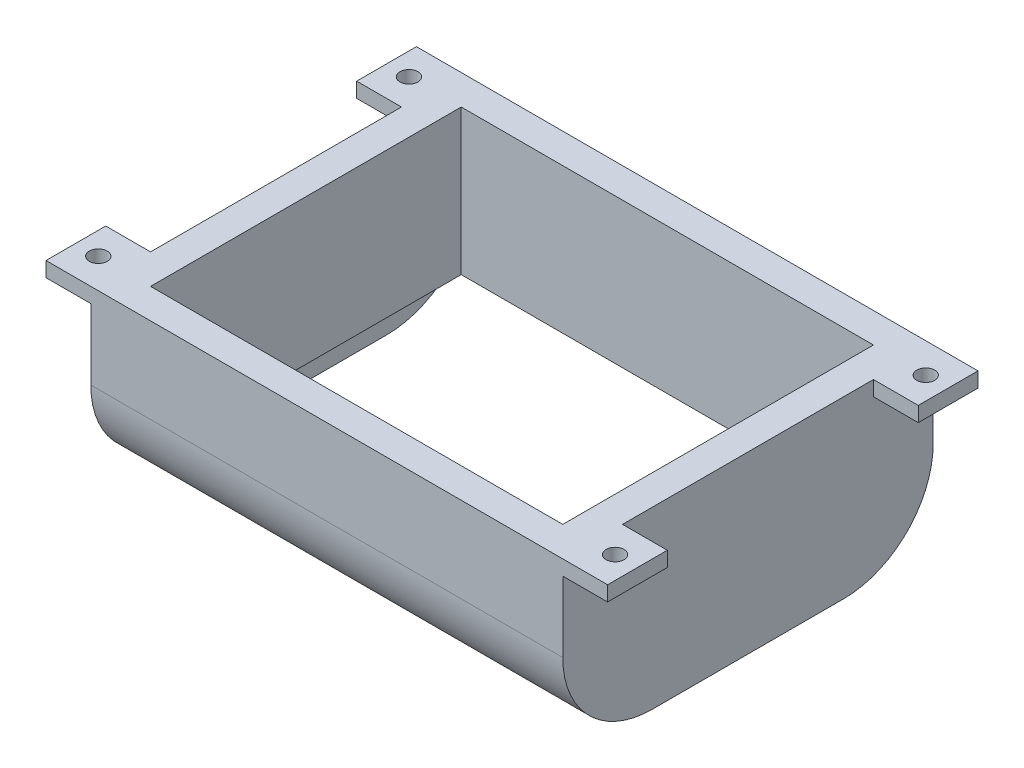
ISO-10303-21;
HEADER;
FILE_DESCRIPTION(('STEP AP214'),'2;1');
FILE_NAME('part.step','',(''),(''),'','','');
FILE_SCHEMA(('AUTOMOTIVE_DESIGN { 1 0 10303 214 1 1 1 1 }'));
ENDSEC;
DATA;
#1=APPLICATION_CONTEXT('core data for automotive mechanical design processes');
#2=APPLICATION_PROTOCOL_DEFINITION('international standard','automotive_design',2000,#1);
#3=PRODUCT_CONTEXT('',#1,'mechanical');
#4=PRODUCT('Part','Part','',(#3));
#5=PRODUCT_RELATED_PRODUCT_CATEGORY('part','',(#4));
#6=PRODUCT_DEFINITION_FORMATION('','',#4);
#7=PRODUCT_DEFINITION_CONTEXT('part definition',#1,'design');
#8=PRODUCT_DEFINITION('design','',#6,#7);
#9=PRODUCT_DEFINITION_SHAPE('','',#8);
#10=(LENGTH_UNIT() NAMED_UNIT(*) SI_UNIT(.MILLI.,.METRE.));
#11=(NAMED_UNIT(*) PLANE_ANGLE_UNIT() SI_UNIT($,.RADIAN.));
#12=(NAMED_UNIT(*) SI_UNIT($,.STERADIAN.) SOLID_ANGLE_UNIT());
#13=UNCERTAINTY_MEASURE_WITH_UNIT(LENGTH_MEASURE(1.E-05),#10,'distance_accuracy_value','');
#14=(GEOMETRIC_REPRESENTATION_CONTEXT(3) GLOBAL_UNCERTAINTY_ASSIGNED_CONTEXT((#13)) GLOBAL_UNIT_ASSIGNED_CONTEXT((#10,
#11,#12)) REPRESENTATION_CONTEXT('',''));
#15=CARTESIAN_POINT('',(0.,0.,0.));
#16=DIRECTION('',(0.,0.,1.));
#17=DIRECTION('',(1.,0.,0.));
#18=AXIS2_PLACEMENT_3D('',#15,#16,#17);
#19=CARTESIAN_POINT('',(0.,-5.,0.));
#20=DIRECTION('',(0.,1.,0.));
#21=DIRECTION('',(0.,0.,1.));
#22=AXIS2_PLACEMENT_3D('',#19,#20,#21);
#23=PLANE('',#22);
#24=DIRECTION('',(0.,0.,-1.));
#25=VECTOR('',#24,1.);
#26=CARTESIAN_POINT('',(-39.5,-5.,31.));
#27=LINE('',#26,#25);
#28=CARTESIAN_POINT('',(-39.4999999999999,-5.,16.));
#29=VERTEX_POINT('',#28);
#30=CARTESIAN_POINT('',(-39.4999999999999,-5.,-16.));
#31=VERTEX_POINT('',#30);
#32=EDGE_CURVE('E358',#29,#31,#27,.T.);
#33=ORIENTED_EDGE('',*,*,#32,.T.);
#34=DIRECTION('',(-1.,0.,0.));
#35=VECTOR('',#34,1.);
#36=CARTESIAN_POINT('',(0.,-5.,-16.));
#37=LINE('',#36,#35);
#38=CARTESIAN_POINT('',(-37.,-5.,-16.));
#39=VERTEX_POINT('',#38);
#40=EDGE_CURVE('E436',#31,#39,#37,.F.);
#41=ORIENTED_EDGE('',*,*,#40,.T.);
#42=DIRECTION('',(0.,0.,-1.));
#43=VECTOR('',#42,1.);
#44=CARTESIAN_POINT('',(-37.,-5.,0.));
#45=LINE('',#44,#43);
#46=CARTESIAN_POINT('',(-37.,-5.,16.));
#47=VERTEX_POINT('',#46);
#48=EDGE_CURVE('E349',#47,#39,#45,.T.);
#49=ORIENTED_EDGE('',*,*,#48,.F.);
#50=DIRECTION('',(-1.,0.,0.));
#51=VECTOR('',#50,1.);
#52=CARTESIAN_POINT('',(0.,-5.,16.));
#53=LINE('',#52,#51);
#54=EDGE_CURVE('E429',#47,#29,#53,.T.);
#55=ORIENTED_EDGE('',*,*,#54,.T.);
#56=EDGE_LOOP('',(#33,#41,#49,#55));
#57=FACE_BOUND('',#56,.T.);
#58=ADVANCED_FACE('F63',(#57),#23,.F.);
#59=CARTESIAN_POINT('',(-39.5,24.3,31.));
#60=DIRECTION('',(1.,0.,0.));
#61=DIRECTION('',(0.,0.,-1.));
#62=AXIS2_PLACEMENT_3D('',#59,#60,#61);
#63=PLANE('',#62);
#64=DIRECTION('',(0.,-1.,0.));
#65=VECTOR('',#64,1.);
#66=CARTESIAN_POINT('',(-39.4999999999999,24.3,-31.));
#67=LINE('',#66,#65);
#68=CARTESIAN_POINT('',(-39.4999999999999,21.8,-31.));
#69=VERTEX_POINT('',#68);
#70=CARTESIAN_POINT('',(-39.4999999999999,10.,-31.));
#71=VERTEX_POINT('',#70);
#72=EDGE_CURVE('E404',#69,#71,#67,.T.);
#73=ORIENTED_EDGE('',*,*,#72,.T.);
#74=CARTESIAN_POINT('',(-39.4999999999999,10.,-16.));
#75=DIRECTION('',(1.,0.,0.));
#76=DIRECTION('',(0.,0.,-1.));
#77=AXIS2_PLACEMENT_3D('',#74,#75,#76);
#78=CIRCLE('',#77,15.);
#79=EDGE_CURVE('E427',#71,#31,#78,.F.);
#80=ORIENTED_EDGE('',*,*,#79,.T.);
#81=ORIENTED_EDGE('',*,*,#32,.F.);
#82=CARTESIAN_POINT('',(-39.4999999999999,10.,16.));
#83=DIRECTION('',(1.,0.,0.));
#84=DIRECTION('',(0.,0.,-1.));
#85=AXIS2_PLACEMENT_3D('',#82,#83,#84);
#86=CIRCLE('',#85,15.);
#87=CARTESIAN_POINT('',(-39.5,10.,31.));
#88=VERTEX_POINT('',#87);
#89=EDGE_CURVE('E425',#29,#88,#86,.F.);
#90=ORIENTED_EDGE('',*,*,#89,.T.);
#91=DIRECTION('',(0.,-1.,0.));
#92=VECTOR('',#91,1.);
#93=CARTESIAN_POINT('',(-39.5,24.3,31.));
#94=LINE('',#93,#92);
#95=CARTESIAN_POINT('',(-39.5,21.8,31.));
#96=VERTEX_POINT('',#95);
#97=EDGE_CURVE('E402',#96,#88,#94,.T.);
#98=ORIENTED_EDGE('',*,*,#97,.F.);
#99=DIRECTION('',(0.,0.,1.));
#100=VECTOR('',#99,1.);
#101=CARTESIAN_POINT('',(-39.5,21.8,30.9999999999999));
#102=LINE('',#101,#100);
#103=CARTESIAN_POINT('',(-39.5,21.8,20.9999999999999));
#104=VERTEX_POINT('',#103);
#105=EDGE_CURVE('E307',#104,#96,#102,.T.);
#106=ORIENTED_EDGE('',*,*,#105,.F.);
#107=DIRECTION('',(0.,-1.,0.));
#108=VECTOR('',#107,1.);
#109=CARTESIAN_POINT('',(-39.5,24.3,20.9999999999999));
#110=LINE('',#109,#108);
#111=CARTESIAN_POINT('',(-39.5,24.3,20.9999999999999));
#112=VERTEX_POINT('',#111);
#113=EDGE_CURVE('E310',#112,#104,#110,.T.);
#114=ORIENTED_EDGE('',*,*,#113,.F.);
#115=DIRECTION('',(0.,0.,1.));
#116=VECTOR('',#115,1.);
#117=CARTESIAN_POINT('',(-39.5,24.3,31.));
#118=LINE('',#117,#116);
#119=CARTESIAN_POINT('',(-39.4999999999999,24.3,-21.));
#120=VERTEX_POINT('',#119);
#121=EDGE_CURVE('E396',#120,#112,#118,.T.);
#122=ORIENTED_EDGE('',*,*,#121,.F.);
#123=DIRECTION('',(0.,1.,0.));
#124=VECTOR('',#123,1.);
#125=CARTESIAN_POINT('',(-39.4999999999999,24.3,-21.));
#126=LINE('',#125,#124);
#127=CARTESIAN_POINT('',(-39.4999999999999,21.8,-21.));
#128=VERTEX_POINT('',#127);
#129=EDGE_CURVE('E325',#128,#120,#126,.T.);
#130=ORIENTED_EDGE('',*,*,#129,.F.);
#131=DIRECTION('',(0.,0.,1.));
#132=VECTOR('',#131,1.);
#133=CARTESIAN_POINT('',(-39.4999999999999,21.8,-31.));
#134=LINE('',#133,#132);
#135=EDGE_CURVE('E313',#69,#128,#134,.T.);
#136=ORIENTED_EDGE('',*,*,#135,.F.);
#137=EDGE_LOOP('',(#73,#80,#81,#90,#98,#106,#114,#122,#130,#136));
#138=FACE_BOUND('',#137,.T.);
#139=ADVANCED_FACE('F467',(#138),#63,.F.);
#140=CARTESIAN_POINT('',(0.,0.,0.));
#141=DIRECTION('',(0.,1.,0.));
#142=DIRECTION('',(0.,0.,1.));
#143=AXIS2_PLACEMENT_3D('',#140,#141,#142);
#144=PLANE('',#143);
#145=DIRECTION('',(0.,0.,1.));
#146=VECTOR('',#145,1.);
#147=CARTESIAN_POINT('',(-34.5,0.,26.));
#148=LINE('',#147,#146);
#149=CARTESIAN_POINT('',(-34.5,0.,-26.));
#150=VERTEX_POINT('',#149);
#151=CARTESIAN_POINT('',(-34.5,0.,26.));
#152=VERTEX_POINT('',#151);
#153=EDGE_CURVE('E361',#150,#152,#148,.T.);
#154=ORIENTED_EDGE('',*,*,#153,.T.);
#155=DIRECTION('',(1.,0.,0.));
#156=VECTOR('',#155,1.);
#157=CARTESIAN_POINT('',(34.5,0.,26.));
#158=LINE('',#157,#156);
#159=CARTESIAN_POINT('',(34.5,0.,26.));
#160=VERTEX_POINT('',#159);
#161=EDGE_CURVE('E375',#152,#160,#158,.T.);
#162=ORIENTED_EDGE('',*,*,#161,.T.);
#163=DIRECTION('',(0.,0.,-1.));
#164=VECTOR('',#163,1.);
#165=CARTESIAN_POINT('',(34.5,0.,26.));
#166=LINE('',#165,#164);
#167=CARTESIAN_POINT('',(34.5,0.,-26.));
#168=VERTEX_POINT('',#167);
#169=EDGE_CURVE('E378',#160,#168,#166,.T.);
#170=ORIENTED_EDGE('',*,*,#169,.T.);
#171=DIRECTION('',(-1.,0.,0.));
#172=VECTOR('',#171,1.);
#173=CARTESIAN_POINT('',(34.5,0.,-26.));
#174=LINE('',#173,#172);
#175=EDGE_CURVE('E365',#168,#150,#174,.T.);
#176=ORIENTED_EDGE('',*,*,#175,.T.);
#177=EDGE_LOOP('',(#154,#162,#170,#176));
#178=FACE_BOUND('',#177,.T.);
#179=DIRECTION('',(0.,0.,-1.));
#180=VECTOR('',#179,1.);
#181=CARTESIAN_POINT('',(-37.,0.,0.));
#182=LINE('',#181,#180);
#183=CARTESIAN_POINT('',(-37.,0.,27.1803398874989));
#184=VERTEX_POINT('',#183);
#185=CARTESIAN_POINT('',(-37.,0.,-27.180339887499));
#186=VERTEX_POINT('',#185);
#187=EDGE_CURVE('E350',#184,#186,#182,.T.);
#188=ORIENTED_EDGE('',*,*,#187,.T.);
#189=DIRECTION('',(-1.,0.,0.));
#190=VECTOR('',#189,1.);
#191=CARTESIAN_POINT('',(-37.,0.,-27.180339887499));
#192=LINE('',#191,#190);
#193=CARTESIAN_POINT('',(37.,0.,-27.180339887499));
#194=VERTEX_POINT('',#193);
#195=EDGE_CURVE('E84',#186,#194,#192,.F.);
#196=ORIENTED_EDGE('',*,*,#195,.T.);
#197=DIRECTION('',(0.,0.,-1.));
#198=VECTOR('',#197,1.);
#199=CARTESIAN_POINT('',(37.,0.,0.));
#200=LINE('',#199,#198);
#201=CARTESIAN_POINT('',(37.,0.,27.1803398874989));
#202=VERTEX_POINT('',#201);
#203=EDGE_CURVE('E345',#202,#194,#200,.T.);
#204=ORIENTED_EDGE('',*,*,#203,.F.);
#205=DIRECTION('',(-1.,0.,0.));
#206=VECTOR('',#205,1.);
#207=CARTESIAN_POINT('',(37.,0.,27.1803398874989));
#208=LINE('',#207,#206);
#209=EDGE_CURVE('E442',#202,#184,#208,.T.);
#210=ORIENTED_EDGE('',*,*,#209,.T.);
#211=EDGE_LOOP('',(#188,#196,#204,#210));
#212=FACE_BOUND('',#211,.T.);
#213=ADVANCED_FACE('F521',(#178,#212),#144,.F.);
#214=CARTESIAN_POINT('',(0.,24.3,0.));
#215=DIRECTION('',(0.,1.,0.));
#216=DIRECTION('',(0.,0.,1.));
#217=AXIS2_PLACEMENT_3D('',#214,#215,#216);
#218=PLANE('',#217);
#219=CARTESIAN_POINT('',(43.2499999999999,24.3000000000003,-25.9999999999998));
#220=DIRECTION('',(0.,-1.,0.));
#221=DIRECTION('',(0.,0.,1.));
#222=AXIS2_PLACEMENT_3D('',#219,#220,#221);
#223=CIRCLE('',#222,1.5);
#224=CARTESIAN_POINT('',(43.2499999999999,24.3000000000003,-24.4999999999998));
#225=VERTEX_POINT('',#224);
#226=EDGE_CURVE('E601',#225,#225,#223,.T.);
#227=ORIENTED_EDGE('',*,*,#226,.T.);
#228=EDGE_LOOP('',(#227));
#229=FACE_BOUND('',#228,.T.);
#230=CARTESIAN_POINT('',(-43.2499999999999,24.3000000000003,-25.9999999999999));
#231=DIRECTION('',(0.,-1.,0.));
#232=DIRECTION('',(0.,0.,-1.));
#233=AXIS2_PLACEMENT_3D('',#230,#231,#232);
#234=CIRCLE('',#233,1.5);
#235=CARTESIAN_POINT('',(-43.2499999999999,24.3000000000003,-27.4999999999999));
#236=VERTEX_POINT('',#235);
#237=EDGE_CURVE('E597',#236,#236,#234,.T.);
#238=ORIENTED_EDGE('',*,*,#237,.T.);
#239=EDGE_LOOP('',(#238));
#240=FACE_BOUND('',#239,.T.);
#241=CARTESIAN_POINT('',(-43.2499999999999,24.3,25.9999999999999));
#242=DIRECTION('',(0.,-1.,0.));
#243=DIRECTION('',(0.,0.,1.));
#244=AXIS2_PLACEMENT_3D('',#241,#242,#243);
#245=CIRCLE('',#244,1.5);
#246=CARTESIAN_POINT('',(-43.2499999999999,24.3,27.4999999999999));
#247=VERTEX_POINT('',#246);
#248=EDGE_CURVE('E594',#247,#247,#245,.T.);
#249=ORIENTED_EDGE('',*,*,#248,.T.);
#250=EDGE_LOOP('',(#249));
#251=FACE_BOUND('',#250,.T.);
#252=CARTESIAN_POINT('',(43.2499999999999,24.3,25.9999999999999));
#253=DIRECTION('',(0.,-1.,0.));
#254=DIRECTION('',(0.,0.,-1.));
#255=AXIS2_PLACEMENT_3D('',#252,#253,#254);
#256=CIRCLE('',#255,1.5);
#257=CARTESIAN_POINT('',(43.2499999999999,24.3,24.4999999999999));
#258=VERTEX_POINT('',#257);
#259=EDGE_CURVE('E415',#258,#258,#256,.T.);
#260=ORIENTED_EDGE('',*,*,#259,.T.);
#261=EDGE_LOOP('',(#260));
#262=FACE_BOUND('',#261,.T.);
#263=DIRECTION('',(1.,0.,0.));
#264=VECTOR('',#263,1.);
#265=CARTESIAN_POINT('',(39.4999999999999,24.3,31.));
#266=LINE('',#265,#264);
#267=CARTESIAN_POINT('',(-47.,24.3,30.9999999999999));
#268=VERTEX_POINT('',#267);
#269=CARTESIAN_POINT('',(47.,24.3,30.9999999999999));
#270=VERTEX_POINT('',#269);
#271=EDGE_CURVE('E399',#268,#270,#266,.T.);
#272=ORIENTED_EDGE('',*,*,#271,.T.);
#273=DIRECTION('',(0.,0.,-1.));
#274=VECTOR('',#273,1.);
#275=CARTESIAN_POINT('',(47.,24.3,30.9999999999999));
#276=LINE('',#275,#274);
#277=CARTESIAN_POINT('',(47.,24.3,20.9999999999999));
#278=VERTEX_POINT('',#277);
#279=EDGE_CURVE('E256',#270,#278,#276,.T.);
#280=ORIENTED_EDGE('',*,*,#279,.T.);
#281=DIRECTION('',(-1.,0.,0.));
#282=VECTOR('',#281,1.);
#283=CARTESIAN_POINT('',(47.,24.3,20.9999999999999));
#284=LINE('',#283,#282);
#285=CARTESIAN_POINT('',(39.4999999999999,24.3,20.9999999999999));
#286=VERTEX_POINT('',#285);
#287=EDGE_CURVE('E267',#278,#286,#284,.T.);
#288=ORIENTED_EDGE('',*,*,#287,.T.);
#289=DIRECTION('',(0.,0.,-1.));
#290=VECTOR('',#289,1.);
#291=CARTESIAN_POINT('',(39.4999999999999,24.3,31.));
#292=LINE('',#291,#290);
#293=CARTESIAN_POINT('',(39.5,24.3,-21.));
#294=VERTEX_POINT('',#293);
#295=EDGE_CURVE('E392',#286,#294,#292,.T.);
#296=ORIENTED_EDGE('',*,*,#295,.T.);
#297=DIRECTION('',(-1.,0.,0.));
#298=VECTOR('',#297,1.);
#299=CARTESIAN_POINT('',(46.9999999999999,24.3,-21.));
#300=LINE('',#299,#298);
#301=CARTESIAN_POINT('',(46.9999999999999,24.3,-21.));
#302=VERTEX_POINT('',#301);
#303=EDGE_CURVE('E296',#302,#294,#300,.T.);
#304=ORIENTED_EDGE('',*,*,#303,.F.);
#305=DIRECTION('',(0.,0.,-1.));
#306=VECTOR('',#305,1.);
#307=CARTESIAN_POINT('',(46.9999999999999,24.3,-31.));
#308=LINE('',#307,#306);
#309=CARTESIAN_POINT('',(46.9999999999999,24.3,-31.));
#310=VERTEX_POINT('',#309);
#311=EDGE_CURVE('E278',#302,#310,#308,.T.);
#312=ORIENTED_EDGE('',*,*,#311,.T.);
#313=DIRECTION('',(-1.,0.,0.));
#314=VECTOR('',#313,1.);
#315=CARTESIAN_POINT('',(39.5,24.3,-31.));
#316=LINE('',#315,#314);
#317=CARTESIAN_POINT('',(-46.9999999999999,24.3,-31.));
#318=VERTEX_POINT('',#317);
#319=EDGE_CURVE('E394',#310,#318,#316,.T.);
#320=ORIENTED_EDGE('',*,*,#319,.T.);
#321=DIRECTION('',(0.,0.,-1.));
#322=VECTOR('',#321,1.);
#323=CARTESIAN_POINT('',(-46.9999999999999,24.3,-31.));
#324=LINE('',#323,#322);
#325=CARTESIAN_POINT('',(-46.9999999999999,24.3,-21.));
#326=VERTEX_POINT('',#325);
#327=EDGE_CURVE('E329',#326,#318,#324,.T.);
#328=ORIENTED_EDGE('',*,*,#327,.F.);
#329=DIRECTION('',(1.,0.,0.));
#330=VECTOR('',#329,1.);
#331=CARTESIAN_POINT('',(-46.9999999999999,24.3,-21.));
#332=LINE('',#331,#330);
#333=EDGE_CURVE('E332',#326,#120,#332,.T.);
#334=ORIENTED_EDGE('',*,*,#333,.T.);
#335=ORIENTED_EDGE('',*,*,#121,.T.);
#336=DIRECTION('',(1.,0.,0.));
#337=VECTOR('',#336,1.);
#338=CARTESIAN_POINT('',(-47.,24.3,20.9999999999999));
#339=LINE('',#338,#337);
#340=CARTESIAN_POINT('',(-47.,24.3,20.9999999999999));
#341=VERTEX_POINT('',#340);
#342=EDGE_CURVE('E299',#341,#112,#339,.T.);
#343=ORIENTED_EDGE('',*,*,#342,.F.);
#344=DIRECTION('',(0.,0.,-1.));
#345=VECTOR('',#344,1.);
#346=CARTESIAN_POINT('',(-47.,24.3,30.9999999999999));
#347=LINE('',#346,#345);
#348=EDGE_CURVE('E317',#268,#341,#347,.T.);
#349=ORIENTED_EDGE('',*,*,#348,.F.);
#350=EDGE_LOOP('',(#272,#280,#288,#296,#304,#312,#320,#328,#334,#335,#343,#349));
#351=FACE_BOUND('',#350,.T.);
#352=DIRECTION('',(1.,0.,0.));
#353=VECTOR('',#352,1.);
#354=CARTESIAN_POINT('',(34.5,24.3,26.));
#355=LINE('',#354,#353);
#356=CARTESIAN_POINT('',(-34.5,24.3,26.));
#357=VERTEX_POINT('',#356);
#358=CARTESIAN_POINT('',(34.5,24.3,26.));
#359=VERTEX_POINT('',#358);
#360=EDGE_CURVE('E364',#357,#359,#355,.T.);
#361=ORIENTED_EDGE('',*,*,#360,.F.);
#362=DIRECTION('',(0.,0.,1.));
#363=VECTOR('',#362,1.);
#364=CARTESIAN_POINT('',(-34.5,24.3,26.));
#365=LINE('',#364,#363);
#366=CARTESIAN_POINT('',(-34.5,24.3,-26.));
#367=VERTEX_POINT('',#366);
#368=EDGE_CURVE('E362',#367,#357,#365,.T.);
#369=ORIENTED_EDGE('',*,*,#368,.F.);
#370=DIRECTION('',(-1.,0.,0.));
#371=VECTOR('',#370,1.);
#372=CARTESIAN_POINT('',(34.5,24.3,-26.));
#373=LINE('',#372,#371);
#374=CARTESIAN_POINT('',(34.5,24.3,-26.));
#375=VERTEX_POINT('',#374);
#376=EDGE_CURVE('E370',#375,#367,#373,.T.);
#377=ORIENTED_EDGE('',*,*,#376,.F.);
#378=DIRECTION('',(0.,0.,-1.));
#379=VECTOR('',#378,1.);
#380=CARTESIAN_POINT('',(34.5,24.3,26.));
#381=LINE('',#380,#379);
#382=EDGE_CURVE('E367',#359,#375,#381,.T.);
#383=ORIENTED_EDGE('',*,*,#382,.F.);
#384=EDGE_LOOP('',(#361,#369,#377,#383));
#385=FACE_BOUND('',#384,.T.);
#386=ADVANCED_FACE('F488',(#229,#240,#251,#262,#351,#385),#218,.T.);
#387=CARTESIAN_POINT('',(39.4999999999999,24.3,31.));
#388=DIRECTION('',(-1.,0.,0.));
#389=DIRECTION('',(0.,0.,1.));
#390=AXIS2_PLACEMENT_3D('',#387,#388,#389);
#391=PLANE('',#390);
#392=DIRECTION('',(0.,0.,-1.));
#393=VECTOR('',#392,1.);
#394=CARTESIAN_POINT('',(39.4999999999999,-5.,31.));
#395=LINE('',#394,#393);
#396=CARTESIAN_POINT('',(39.4999999999999,-5.,16.));
#397=VERTEX_POINT('',#396);
#398=CARTESIAN_POINT('',(39.4999999999999,-5.,-16.));
#399=VERTEX_POINT('',#398);
#400=EDGE_CURVE('E353',#397,#399,#395,.T.);
#401=ORIENTED_EDGE('',*,*,#400,.T.);
#402=CARTESIAN_POINT('',(39.4999999999999,10.,-16.));
#403=DIRECTION('',(-1.,0.,0.));
#404=DIRECTION('',(0.,0.,1.));
#405=AXIS2_PLACEMENT_3D('',#402,#403,#404);
#406=CIRCLE('',#405,15.);
#407=CARTESIAN_POINT('',(39.5,10.,-31.));
#408=VERTEX_POINT('',#407);
#409=EDGE_CURVE('E71',#399,#408,#406,.F.);
#410=ORIENTED_EDGE('',*,*,#409,.T.);
#411=DIRECTION('',(0.,-1.,0.));
#412=VECTOR('',#411,1.);
#413=CARTESIAN_POINT('',(39.5,24.3,-31.));
#414=LINE('',#413,#412);
#415=CARTESIAN_POINT('',(39.4999999999999,21.8,-31.));
#416=VERTEX_POINT('',#415);
#417=EDGE_CURVE('E407',#416,#408,#414,.T.);
#418=ORIENTED_EDGE('',*,*,#417,.F.);
#419=DIRECTION('',(0.,0.,1.));
#420=VECTOR('',#419,1.);
#421=CARTESIAN_POINT('',(39.4999999999999,21.8,-31.));
#422=LINE('',#421,#420);
#423=CARTESIAN_POINT('',(39.4999999999999,21.8,-21.));
#424=VERTEX_POINT('',#423);
#425=EDGE_CURVE('E279',#416,#424,#422,.T.);
#426=ORIENTED_EDGE('',*,*,#425,.T.);
#427=DIRECTION('',(0.,1.,0.));
#428=VECTOR('',#427,1.);
#429=CARTESIAN_POINT('',(39.4999999999999,24.3,-21.));
#430=LINE('',#429,#428);
#431=EDGE_CURVE('E246',#424,#294,#430,.T.);
#432=ORIENTED_EDGE('',*,*,#431,.T.);
#433=ORIENTED_EDGE('',*,*,#295,.F.);
#434=DIRECTION('',(0.,-1.,0.));
#435=VECTOR('',#434,1.);
#436=CARTESIAN_POINT('',(39.5,24.3,20.9999999999999));
#437=LINE('',#436,#435);
#438=CARTESIAN_POINT('',(39.4999999999999,21.8,20.9999999999999));
#439=VERTEX_POINT('',#438);
#440=EDGE_CURVE('E257',#286,#439,#437,.T.);
#441=ORIENTED_EDGE('',*,*,#440,.T.);
#442=DIRECTION('',(0.,0.,1.));
#443=VECTOR('',#442,1.);
#444=CARTESIAN_POINT('',(39.5,21.8,30.9999999999999));
#445=LINE('',#444,#443);
#446=CARTESIAN_POINT('',(39.5,21.8,30.9999999999999));
#447=VERTEX_POINT('',#446);
#448=EDGE_CURVE('E268',#439,#447,#445,.T.);
#449=ORIENTED_EDGE('',*,*,#448,.T.);
#450=DIRECTION('',(0.,-1.,0.));
#451=VECTOR('',#450,1.);
#452=CARTESIAN_POINT('',(39.4999999999999,24.3,31.));
#453=LINE('',#452,#451);
#454=CARTESIAN_POINT('',(39.4999999999999,10.,31.));
#455=VERTEX_POINT('',#454);
#456=EDGE_CURVE('E241',#447,#455,#453,.T.);
#457=ORIENTED_EDGE('',*,*,#456,.T.);
#458=CARTESIAN_POINT('',(39.4999999999999,10.,16.));
#459=DIRECTION('',(-1.,0.,0.));
#460=DIRECTION('',(0.,0.,1.));
#461=AXIS2_PLACEMENT_3D('',#458,#459,#460);
#462=CIRCLE('',#461,15.);
#463=EDGE_CURVE('E449',#455,#397,#462,.F.);
#464=ORIENTED_EDGE('',*,*,#463,.T.);
#465=EDGE_LOOP('',(#401,#410,#418,#426,#432,#433,#441,#449,#457,#464));
#466=FACE_BOUND('',#465,.T.);
#467=ADVANCED_FACE('F453',(#466),#391,.F.);
#468=CARTESIAN_POINT('',(39.5,24.3,-31.));
#469=DIRECTION('',(0.,0.,1.));
#470=DIRECTION('',(1.,0.,0.));
#471=AXIS2_PLACEMENT_3D('',#468,#469,#470);
#472=PLANE('',#471);
#473=ORIENTED_EDGE('',*,*,#417,.T.);
#474=DIRECTION('',(-1.,0.,0.));
#475=VECTOR('',#474,1.);
#476=CARTESIAN_POINT('',(39.5,10.,-31.));
#477=LINE('',#476,#475);
#478=EDGE_CURVE('E410',#408,#71,#477,.T.);
#479=ORIENTED_EDGE('',*,*,#478,.T.);
#480=ORIENTED_EDGE('',*,*,#72,.F.);
#481=DIRECTION('',(1.,0.,0.));
#482=VECTOR('',#481,1.);
#483=CARTESIAN_POINT('',(-46.9999999999999,21.8,-31.));
#484=LINE('',#483,#482);
#485=CARTESIAN_POINT('',(-46.9999999999999,21.8,-31.));
#486=VERTEX_POINT('',#485);
#487=EDGE_CURVE('E342',#486,#69,#484,.T.);
#488=ORIENTED_EDGE('',*,*,#487,.F.);
#489=DIRECTION('',(0.,-1.,0.));
#490=VECTOR('',#489,1.);
#491=CARTESIAN_POINT('',(-46.9999999999999,24.3,-31.));
#492=LINE('',#491,#490);
#493=EDGE_CURVE('E321',#318,#486,#492,.T.);
#494=ORIENTED_EDGE('',*,*,#493,.F.);
#495=ORIENTED_EDGE('',*,*,#319,.F.);
#496=DIRECTION('',(0.,-1.,0.));
#497=VECTOR('',#496,1.);
#498=CARTESIAN_POINT('',(46.9999999999999,24.3,-31.));
#499=LINE('',#498,#497);
#500=CARTESIAN_POINT('',(46.9999999999999,21.8,-31.));
#501=VERTEX_POINT('',#500);
#502=EDGE_CURVE('E275',#310,#501,#499,.T.);
#503=ORIENTED_EDGE('',*,*,#502,.T.);
#504=DIRECTION('',(-1.,0.,0.));
#505=VECTOR('',#504,1.);
#506=CARTESIAN_POINT('',(46.9999999999999,21.8,-31.));
#507=LINE('',#506,#505);
#508=EDGE_CURVE('E288',#501,#416,#507,.T.);
#509=ORIENTED_EDGE('',*,*,#508,.T.);
#510=EDGE_LOOP('',(#473,#479,#480,#488,#494,#495,#503,#509));
#511=FACE_BOUND('',#510,.T.);
#512=ADVANCED_FACE('F459',(#511),#472,.F.);
#513=CARTESIAN_POINT('',(39.4999999999999,24.3,31.));
#514=DIRECTION('',(0.,0.,-1.));
#515=DIRECTION('',(-1.,0.,0.));
#516=AXIS2_PLACEMENT_3D('',#513,#514,#515);
#517=PLANE('',#516);
#518=ORIENTED_EDGE('',*,*,#97,.T.);
#519=DIRECTION('',(-1.,0.,0.));
#520=VECTOR('',#519,1.);
#521=CARTESIAN_POINT('',(39.4999999999999,10.,31.));
#522=LINE('',#521,#520);
#523=EDGE_CURVE('E12',#88,#455,#522,.F.);
#524=ORIENTED_EDGE('',*,*,#523,.T.);
#525=ORIENTED_EDGE('',*,*,#456,.F.);
#526=DIRECTION('',(-1.,0.,0.));
#527=VECTOR('',#526,1.);
#528=CARTESIAN_POINT('',(47.,21.8,30.9999999999999));
#529=LINE('',#528,#527);
#530=CARTESIAN_POINT('',(47.,21.8,30.9999999999999));
#531=VERTEX_POINT('',#530);
#532=EDGE_CURVE('E236',#531,#447,#529,.T.);
#533=ORIENTED_EDGE('',*,*,#532,.F.);
#534=DIRECTION('',(0.,1.,0.));
#535=VECTOR('',#534,1.);
#536=CARTESIAN_POINT('',(47.,24.3,30.9999999999999));
#537=LINE('',#536,#535);
#538=EDGE_CURVE('E239',#531,#270,#537,.T.);
#539=ORIENTED_EDGE('',*,*,#538,.T.);
#540=ORIENTED_EDGE('',*,*,#271,.F.);
#541=DIRECTION('',(0.,1.,0.));
#542=VECTOR('',#541,1.);
#543=CARTESIAN_POINT('',(-47.,24.3,30.9999999999999));
#544=LINE('',#543,#542);
#545=CARTESIAN_POINT('',(-47.,21.8,30.9999999999999));
#546=VERTEX_POINT('',#545);
#547=EDGE_CURVE('E311',#546,#268,#544,.T.);
#548=ORIENTED_EDGE('',*,*,#547,.F.);
#549=DIRECTION('',(1.,0.,0.));
#550=VECTOR('',#549,1.);
#551=CARTESIAN_POINT('',(-47.,21.8,30.9999999999999));
#552=LINE('',#551,#550);
#553=EDGE_CURVE('E304',#546,#96,#552,.T.);
#554=ORIENTED_EDGE('',*,*,#553,.T.);
#555=EDGE_LOOP('',(#518,#524,#525,#533,#539,#540,#548,#554));
#556=FACE_BOUND('',#555,.T.);
#557=ADVANCED_FACE('F238',(#556),#517,.F.);
#558=CARTESIAN_POINT('',(-34.5,24.3,26.));
#559=DIRECTION('',(1.,0.,0.));
#560=DIRECTION('',(0.,0.,-1.));
#561=AXIS2_PLACEMENT_3D('',#558,#559,#560);
#562=PLANE('',#561);
#563=ORIENTED_EDGE('',*,*,#153,.F.);
#564=DIRECTION('',(0.,-1.,0.));
#565=VECTOR('',#564,1.);
#566=CARTESIAN_POINT('',(-34.5,24.3,-26.));
#567=LINE('',#566,#565);
#568=EDGE_CURVE('E372',#367,#150,#567,.T.);
#569=ORIENTED_EDGE('',*,*,#568,.F.);
#570=ORIENTED_EDGE('',*,*,#368,.T.);
#571=DIRECTION('',(0.,-1.,0.));
#572=VECTOR('',#571,1.);
#573=CARTESIAN_POINT('',(-34.5,24.3,26.));
#574=LINE('',#573,#572);
#575=EDGE_CURVE('E389',#357,#152,#574,.T.);
#576=ORIENTED_EDGE('',*,*,#575,.T.);
#577=EDGE_LOOP('',(#563,#569,#570,#576));
#578=FACE_BOUND('',#577,.T.);
#579=ADVANCED_FACE('F646',(#578),#562,.T.);
#580=CARTESIAN_POINT('',(34.5,24.3,26.));
#581=DIRECTION('',(0.,0.,-1.));
#582=DIRECTION('',(-1.,0.,0.));
#583=AXIS2_PLACEMENT_3D('',#580,#581,#582);
#584=PLANE('',#583);
#585=ORIENTED_EDGE('',*,*,#161,.F.);
#586=ORIENTED_EDGE('',*,*,#575,.F.);
#587=ORIENTED_EDGE('',*,*,#360,.T.);
#588=DIRECTION('',(0.,-1.,0.));
#589=VECTOR('',#588,1.);
#590=CARTESIAN_POINT('',(34.5,24.3,26.));
#591=LINE('',#590,#589);
#592=EDGE_CURVE('E387',#359,#160,#591,.T.);
#593=ORIENTED_EDGE('',*,*,#592,.T.);
#594=EDGE_LOOP('',(#585,#586,#587,#593));
#595=FACE_BOUND('',#594,.T.);
#596=ADVANCED_FACE('F817',(#595),#584,.T.);
#597=CARTESIAN_POINT('',(34.5,24.3,26.));
#598=DIRECTION('',(-1.,0.,0.));
#599=DIRECTION('',(0.,0.,1.));
#600=AXIS2_PLACEMENT_3D('',#597,#598,#599);
#601=PLANE('',#600);
#602=ORIENTED_EDGE('',*,*,#169,.F.);
#603=ORIENTED_EDGE('',*,*,#592,.F.);
#604=ORIENTED_EDGE('',*,*,#382,.T.);
#605=DIRECTION('',(0.,-1.,0.));
#606=VECTOR('',#605,1.);
#607=CARTESIAN_POINT('',(34.5,24.3,-26.));
#608=LINE('',#607,#606);
#609=EDGE_CURVE('E385',#375,#168,#608,.T.);
#610=ORIENTED_EDGE('',*,*,#609,.T.);
#611=EDGE_LOOP('',(#602,#603,#604,#610));
#612=FACE_BOUND('',#611,.T.);
#613=ADVANCED_FACE('F536',(#612),#601,.T.);
#614=CARTESIAN_POINT('',(34.5,24.3,-26.));
#615=DIRECTION('',(0.,0.,1.));
#616=DIRECTION('',(1.,0.,0.));
#617=AXIS2_PLACEMENT_3D('',#614,#615,#616);
#618=PLANE('',#617);
#619=ORIENTED_EDGE('',*,*,#175,.F.);
#620=ORIENTED_EDGE('',*,*,#609,.F.);
#621=ORIENTED_EDGE('',*,*,#376,.T.);
#622=ORIENTED_EDGE('',*,*,#568,.T.);
#623=EDGE_LOOP('',(#619,#620,#621,#622));
#624=FACE_BOUND('',#623,.T.);
#625=ADVANCED_FACE('F527',(#624),#618,.T.);
#626=DIRECTION('',(0.,0.,-1.));
#627=VECTOR('',#626,1.);
#628=CARTESIAN_POINT('',(37.,-5.,0.));
#629=LINE('',#628,#627);
#630=CARTESIAN_POINT('',(37.,-5.,16.));
#631=VERTEX_POINT('',#630);
#632=CARTESIAN_POINT('',(37.,-5.,-16.));
#633=VERTEX_POINT('',#632);
#634=EDGE_CURVE('E346',#631,#633,#629,.T.);
#635=ORIENTED_EDGE('',*,*,#634,.T.);
#636=DIRECTION('',(-1.,0.,0.));
#637=VECTOR('',#636,1.);
#638=CARTESIAN_POINT('',(0.,-5.,-16.));
#639=LINE('',#638,#637);
#640=EDGE_CURVE('E434',#633,#399,#639,.F.);
#641=ORIENTED_EDGE('',*,*,#640,.T.);
#642=ORIENTED_EDGE('',*,*,#400,.F.);
#643=DIRECTION('',(-1.,0.,0.));
#644=VECTOR('',#643,1.);
#645=CARTESIAN_POINT('',(0.,-5.,16.));
#646=LINE('',#645,#644);
#647=EDGE_CURVE('E431',#397,#631,#646,.T.);
#648=ORIENTED_EDGE('',*,*,#647,.T.);
#649=EDGE_LOOP('',(#635,#641,#642,#648));
#650=FACE_BOUND('',#649,.T.);
#651=ADVANCED_FACE('F517',(#650),#23,.F.);
#652=CARTESIAN_POINT('',(-37.,-5.,0.));
#653=DIRECTION('',(1.,0.,0.));
#654=DIRECTION('',(0.,0.,-1.));
#655=AXIS2_PLACEMENT_3D('',#652,#653,#654);
#656=PLANE('',#655);
#657=ORIENTED_EDGE('',*,*,#48,.T.);
#658=CARTESIAN_POINT('',(-37.,10.,-16.));
#659=DIRECTION('',(1.,0.,0.));
#660=DIRECTION('',(0.,0.,-1.));
#661=AXIS2_PLACEMENT_3D('',#658,#659,#660);
#662=CIRCLE('',#661,15.);
#663=EDGE_CURVE('E440',#39,#186,#662,.T.);
#664=ORIENTED_EDGE('',*,*,#663,.T.);
#665=ORIENTED_EDGE('',*,*,#187,.F.);
#666=CARTESIAN_POINT('',(-37.,10.,16.));
#667=DIRECTION('',(1.,0.,0.));
#668=DIRECTION('',(0.,0.,-1.));
#669=AXIS2_PLACEMENT_3D('',#666,#667,#668);
#670=CIRCLE('',#669,15.);
#671=EDGE_CURVE('E438',#184,#47,#670,.T.);
#672=ORIENTED_EDGE('',*,*,#671,.T.);
#673=EDGE_LOOP('',(#657,#664,#665,#672));
#674=FACE_BOUND('',#673,.T.);
#675=ADVANCED_FACE('F526',(#674),#656,.T.);
#676=CARTESIAN_POINT('',(37.,-5.,0.));
#677=DIRECTION('',(1.,0.,0.));
#678=DIRECTION('',(0.,0.,-1.));
#679=AXIS2_PLACEMENT_3D('',#676,#677,#678);
#680=PLANE('',#679);
#681=ORIENTED_EDGE('',*,*,#203,.T.);
#682=CARTESIAN_POINT('',(37.,10.,-16.));
#683=DIRECTION('',(1.,0.,0.));
#684=DIRECTION('',(0.,0.,-1.));
#685=AXIS2_PLACEMENT_3D('',#682,#683,#684);
#686=CIRCLE('',#685,15.);
#687=EDGE_CURVE('E447',#194,#633,#686,.F.);
#688=ORIENTED_EDGE('',*,*,#687,.T.);
#689=ORIENTED_EDGE('',*,*,#634,.F.);
#690=CARTESIAN_POINT('',(37.,10.,16.));
#691=DIRECTION('',(1.,0.,0.));
#692=DIRECTION('',(0.,0.,-1.));
#693=AXIS2_PLACEMENT_3D('',#690,#691,#692);
#694=CIRCLE('',#693,15.);
#695=EDGE_CURVE('E445',#631,#202,#694,.F.);
#696=ORIENTED_EDGE('',*,*,#695,.T.);
#697=EDGE_LOOP('',(#681,#688,#689,#696));
#698=FACE_BOUND('',#697,.T.);
#699=ADVANCED_FACE('F533',(#698),#680,.F.);
#700=CARTESIAN_POINT('',(-46.9999999999999,21.8,-31.));
#701=DIRECTION('',(0.,1.,0.));
#702=DIRECTION('',(0.,0.,1.));
#703=AXIS2_PLACEMENT_3D('',#700,#701,#702);
#704=PLANE('',#703);
#705=CARTESIAN_POINT('',(-43.2499999999999,21.8,-25.9999999999999));
#706=DIRECTION('',(0.,1.,0.));
#707=DIRECTION('',(0.,0.,1.));
#708=AXIS2_PLACEMENT_3D('',#705,#706,#707);
#709=CIRCLE('',#708,1.5);
#710=CARTESIAN_POINT('',(-43.2499999999999,21.8,-24.4999999999999));
#711=VERTEX_POINT('',#710);
#712=EDGE_CURVE('E270',#711,#711,#709,.T.);
#713=ORIENTED_EDGE('',*,*,#712,.T.);
#714=EDGE_LOOP('',(#713));
#715=FACE_BOUND('',#714,.T.);
#716=ORIENTED_EDGE('',*,*,#135,.T.);
#717=DIRECTION('',(1.,0.,0.));
#718=VECTOR('',#717,1.);
#719=CARTESIAN_POINT('',(-46.9999999999999,21.8,-21.));
#720=LINE('',#719,#718);
#721=CARTESIAN_POINT('',(-46.9999999999999,21.8,-21.));
#722=VERTEX_POINT('',#721);
#723=EDGE_CURVE('E339',#722,#128,#720,.T.);
#724=ORIENTED_EDGE('',*,*,#723,.F.);
#725=DIRECTION('',(0.,0.,1.));
#726=VECTOR('',#725,1.);
#727=CARTESIAN_POINT('',(-46.9999999999999,21.8,-31.));
#728=LINE('',#727,#726);
#729=EDGE_CURVE('E324',#486,#722,#728,.T.);
#730=ORIENTED_EDGE('',*,*,#729,.F.);
#731=ORIENTED_EDGE('',*,*,#487,.T.);
#732=EDGE_LOOP('',(#716,#724,#730,#731));
#733=FACE_BOUND('',#732,.T.);
#734=ADVANCED_FACE('F499',(#715,#733),#704,.F.);
#735=CARTESIAN_POINT('',(-46.9999999999999,24.3,-21.));
#736=DIRECTION('',(0.,0.,-1.));
#737=DIRECTION('',(-1.,0.,0.));
#738=AXIS2_PLACEMENT_3D('',#735,#736,#737);
#739=PLANE('',#738);
#740=ORIENTED_EDGE('',*,*,#129,.T.);
#741=ORIENTED_EDGE('',*,*,#333,.F.);
#742=DIRECTION('',(0.,1.,0.));
#743=VECTOR('',#742,1.);
#744=CARTESIAN_POINT('',(-46.9999999999999,24.3,-21.));
#745=LINE('',#744,#743);
#746=EDGE_CURVE('E327',#722,#326,#745,.T.);
#747=ORIENTED_EDGE('',*,*,#746,.F.);
#748=ORIENTED_EDGE('',*,*,#723,.T.);
#749=EDGE_LOOP('',(#740,#741,#747,#748));
#750=FACE_BOUND('',#749,.T.);
#751=ADVANCED_FACE('F496',(#750),#739,.F.);
#752=CARTESIAN_POINT('',(-46.9999999999999,0.,0.));
#753=DIRECTION('',(-1.,0.,0.));
#754=DIRECTION('',(0.,0.,1.));
#755=AXIS2_PLACEMENT_3D('',#752,#753,#754);
#756=PLANE('',#755);
#757=ORIENTED_EDGE('',*,*,#493,.T.);
#758=ORIENTED_EDGE('',*,*,#729,.T.);
#759=ORIENTED_EDGE('',*,*,#746,.T.);
#760=ORIENTED_EDGE('',*,*,#327,.T.);
#761=EDGE_LOOP('',(#757,#758,#759,#760));
#762=FACE_BOUND('',#761,.T.);
#763=ADVANCED_FACE('F504',(#762),#756,.T.);
#764=CARTESIAN_POINT('',(-47.,24.3,20.9999999999999));
#765=DIRECTION('',(0.,0.,1.));
#766=DIRECTION('',(1.,0.,0.));
#767=AXIS2_PLACEMENT_3D('',#764,#765,#766);
#768=PLANE('',#767);
#769=ORIENTED_EDGE('',*,*,#113,.T.);
#770=DIRECTION('',(1.,0.,0.));
#771=VECTOR('',#770,1.);
#772=CARTESIAN_POINT('',(-47.,21.8,20.9999999999999));
#773=LINE('',#772,#771);
#774=CARTESIAN_POINT('',(-47.,21.8,20.9999999999999));
#775=VERTEX_POINT('',#774);
#776=EDGE_CURVE('E301',#775,#104,#773,.T.);
#777=ORIENTED_EDGE('',*,*,#776,.F.);
#778=DIRECTION('',(0.,-1.,0.));
#779=VECTOR('',#778,1.);
#780=CARTESIAN_POINT('',(-47.,24.3,20.9999999999999));
#781=LINE('',#780,#779);
#782=EDGE_CURVE('E315',#341,#775,#781,.T.);
#783=ORIENTED_EDGE('',*,*,#782,.F.);
#784=ORIENTED_EDGE('',*,*,#342,.T.);
#785=EDGE_LOOP('',(#769,#777,#783,#784));
#786=FACE_BOUND('',#785,.T.);
#787=ADVANCED_FACE('F506',(#786),#768,.F.);
#788=CARTESIAN_POINT('',(-47.,21.8,30.9999999999999));
#789=DIRECTION('',(0.,1.,0.));
#790=DIRECTION('',(0.,0.,1.));
#791=AXIS2_PLACEMENT_3D('',#788,#789,#790);
#792=PLANE('',#791);
#793=CARTESIAN_POINT('',(-43.2499999999999,21.8,25.9999999999999));
#794=DIRECTION('',(0.,1.,0.));
#795=DIRECTION('',(0.,0.,1.));
#796=AXIS2_PLACEMENT_3D('',#793,#794,#795);
#797=CIRCLE('',#796,1.5);
#798=CARTESIAN_POINT('',(-43.2499999999999,21.8,27.4999999999999));
#799=VERTEX_POINT('',#798);
#800=EDGE_CURVE('E418',#799,#799,#797,.T.);
#801=ORIENTED_EDGE('',*,*,#800,.T.);
#802=EDGE_LOOP('',(#801));
#803=FACE_BOUND('',#802,.T.);
#804=ORIENTED_EDGE('',*,*,#105,.T.);
#805=ORIENTED_EDGE('',*,*,#553,.F.);
#806=DIRECTION('',(0.,0.,1.));
#807=VECTOR('',#806,1.);
#808=CARTESIAN_POINT('',(-47.,21.8,30.9999999999999));
#809=LINE('',#808,#807);
#810=EDGE_CURVE('E306',#775,#546,#809,.T.);
#811=ORIENTED_EDGE('',*,*,#810,.F.);
#812=ORIENTED_EDGE('',*,*,#776,.T.);
#813=EDGE_LOOP('',(#804,#805,#811,#812));
#814=FACE_BOUND('',#813,.T.);
#815=ADVANCED_FACE('F482',(#803,#814),#792,.F.);
#816=CARTESIAN_POINT('',(-46.9999999999999,0.,0.));
#817=DIRECTION('',(1.,0.,0.));
#818=DIRECTION('',(0.,0.,-1.));
#819=AXIS2_PLACEMENT_3D('',#816,#817,#818);
#820=PLANE('',#819);
#821=ORIENTED_EDGE('',*,*,#547,.T.);
#822=ORIENTED_EDGE('',*,*,#348,.T.);
#823=ORIENTED_EDGE('',*,*,#782,.T.);
#824=ORIENTED_EDGE('',*,*,#810,.T.);
#825=EDGE_LOOP('',(#821,#822,#823,#824));
#826=FACE_BOUND('',#825,.T.);
#827=ADVANCED_FACE('F547',(#826),#820,.F.);
#828=CARTESIAN_POINT('',(46.9999999999999,24.3,-21.));
#829=DIRECTION('',(0.,0.,1.));
#830=DIRECTION('',(1.,0.,0.));
#831=AXIS2_PLACEMENT_3D('',#828,#829,#830);
#832=PLANE('',#831);
#833=ORIENTED_EDGE('',*,*,#431,.F.);
#834=DIRECTION('',(-1.,0.,0.));
#835=VECTOR('',#834,1.);
#836=CARTESIAN_POINT('',(46.9999999999999,21.8,-21.));
#837=LINE('',#836,#835);
#838=CARTESIAN_POINT('',(46.9999999999999,21.8,-21.));
#839=VERTEX_POINT('',#838);
#840=EDGE_CURVE('E294',#839,#424,#837,.T.);
#841=ORIENTED_EDGE('',*,*,#840,.F.);
#842=DIRECTION('',(0.,1.,0.));
#843=VECTOR('',#842,1.);
#844=CARTESIAN_POINT('',(46.9999999999999,24.3,-21.));
#845=LINE('',#844,#843);
#846=EDGE_CURVE('E282',#839,#302,#845,.T.);
#847=ORIENTED_EDGE('',*,*,#846,.T.);
#848=ORIENTED_EDGE('',*,*,#303,.T.);
#849=EDGE_LOOP('',(#833,#841,#847,#848));
#850=FACE_BOUND('',#849,.T.);
#851=ADVANCED_FACE('F549',(#850),#832,.T.);
#852=CARTESIAN_POINT('',(46.9999999999999,21.8,-31.));
#853=DIRECTION('',(0.,-1.,0.));
#854=DIRECTION('',(0.,0.,-1.));
#855=AXIS2_PLACEMENT_3D('',#852,#853,#854);
#856=PLANE('',#855);
#857=CARTESIAN_POINT('',(43.2499999999999,21.8,-25.9999999999998));
#858=DIRECTION('',(0.,-1.,0.));
#859=DIRECTION('',(0.,0.,-1.));
#860=AXIS2_PLACEMENT_3D('',#857,#858,#859);
#861=CIRCLE('',#860,1.5);
#862=CARTESIAN_POINT('',(43.2499999999999,21.8,-27.4999999999998));
#863=VERTEX_POINT('',#862);
#864=EDGE_CURVE('E414',#863,#863,#861,.T.);
#865=ORIENTED_EDGE('',*,*,#864,.F.);
#866=EDGE_LOOP('',(#865));
#867=FACE_BOUND('',#866,.T.);
#868=ORIENTED_EDGE('',*,*,#425,.F.);
#869=ORIENTED_EDGE('',*,*,#508,.F.);
#870=DIRECTION('',(0.,0.,1.));
#871=VECTOR('',#870,1.);
#872=CARTESIAN_POINT('',(46.9999999999999,21.8,-31.));
#873=LINE('',#872,#871);
#874=EDGE_CURVE('E285',#501,#839,#873,.T.);
#875=ORIENTED_EDGE('',*,*,#874,.T.);
#876=ORIENTED_EDGE('',*,*,#840,.T.);
#877=EDGE_LOOP('',(#868,#869,#875,#876));
#878=FACE_BOUND('',#877,.T.);
#879=ADVANCED_FACE('F554',(#867,#878),#856,.T.);
#880=CARTESIAN_POINT('',(46.9999999999999,0.,0.));
#881=DIRECTION('',(1.,0.,0.));
#882=DIRECTION('',(0.,0.,1.));
#883=AXIS2_PLACEMENT_3D('',#880,#881,#882);
#884=PLANE('',#883);
#885=ORIENTED_EDGE('',*,*,#502,.F.);
#886=ORIENTED_EDGE('',*,*,#311,.F.);
#887=ORIENTED_EDGE('',*,*,#846,.F.);
#888=ORIENTED_EDGE('',*,*,#874,.F.);
#889=EDGE_LOOP('',(#885,#886,#887,#888));
#890=FACE_BOUND('',#889,.T.);
#891=ADVANCED_FACE('F562',(#890),#884,.T.);
#892=CARTESIAN_POINT('',(47.,21.8,30.9999999999999));
#893=DIRECTION('',(0.,-1.,0.));
#894=DIRECTION('',(0.,0.,-1.));
#895=AXIS2_PLACEMENT_3D('',#892,#893,#894);
#896=PLANE('',#895);
#897=CARTESIAN_POINT('',(43.2499999999999,21.8,25.9999999999999));
#898=DIRECTION('',(0.,-1.,0.));
#899=DIRECTION('',(0.,0.,-1.));
#900=AXIS2_PLACEMENT_3D('',#897,#898,#899);
#901=CIRCLE('',#900,1.5);
#902=CARTESIAN_POINT('',(43.2499999999999,21.8,24.4999999999999));
#903=VERTEX_POINT('',#902);
#904=EDGE_CURVE('E411',#903,#903,#901,.T.);
#905=ORIENTED_EDGE('',*,*,#904,.F.);
#906=EDGE_LOOP('',(#905));
#907=FACE_BOUND('',#906,.T.);
#908=ORIENTED_EDGE('',*,*,#448,.F.);
#909=DIRECTION('',(-1.,0.,0.));
#910=VECTOR('',#909,1.);
#911=CARTESIAN_POINT('',(47.,21.8,20.9999999999999));
#912=LINE('',#911,#910);
#913=CARTESIAN_POINT('',(47.,21.8,20.9999999999999));
#914=VERTEX_POINT('',#913);
#915=EDGE_CURVE('E247',#914,#439,#912,.T.);
#916=ORIENTED_EDGE('',*,*,#915,.F.);
#917=DIRECTION('',(0.,0.,1.));
#918=VECTOR('',#917,1.);
#919=CARTESIAN_POINT('',(47.,21.8,30.9999999999999));
#920=LINE('',#919,#918);
#921=EDGE_CURVE('E253',#914,#531,#920,.T.);
#922=ORIENTED_EDGE('',*,*,#921,.T.);
#923=ORIENTED_EDGE('',*,*,#532,.T.);
#924=EDGE_LOOP('',(#908,#916,#922,#923));
#925=FACE_BOUND('',#924,.T.);
#926=ADVANCED_FACE('F259',(#907,#925),#896,.T.);
#927=CARTESIAN_POINT('',(47.,24.3,20.9999999999999));
#928=DIRECTION('',(0.,0.,-1.));
#929=DIRECTION('',(-1.,0.,0.));
#930=AXIS2_PLACEMENT_3D('',#927,#928,#929);
#931=PLANE('',#930);
#932=ORIENTED_EDGE('',*,*,#440,.F.);
#933=ORIENTED_EDGE('',*,*,#287,.F.);
#934=DIRECTION('',(0.,-1.,0.));
#935=VECTOR('',#934,1.);
#936=CARTESIAN_POINT('',(47.,24.3,20.9999999999999));
#937=LINE('',#936,#935);
#938=EDGE_CURVE('E261',#278,#914,#937,.T.);
#939=ORIENTED_EDGE('',*,*,#938,.T.);
#940=ORIENTED_EDGE('',*,*,#915,.T.);
#941=EDGE_LOOP('',(#932,#933,#939,#940));
#942=FACE_BOUND('',#941,.T.);
#943=ADVANCED_FACE('F545',(#942),#931,.T.);
#944=CARTESIAN_POINT('',(46.9999999999999,0.,0.));
#945=DIRECTION('',(-1.,0.,0.));
#946=DIRECTION('',(0.,0.,-1.));
#947=AXIS2_PLACEMENT_3D('',#944,#945,#946);
#948=PLANE('',#947);
#949=ORIENTED_EDGE('',*,*,#538,.F.);
#950=ORIENTED_EDGE('',*,*,#921,.F.);
#951=ORIENTED_EDGE('',*,*,#938,.F.);
#952=ORIENTED_EDGE('',*,*,#279,.F.);
#953=EDGE_LOOP('',(#949,#950,#951,#952));
#954=FACE_BOUND('',#953,.T.);
#955=ADVANCED_FACE('F251',(#954),#948,.F.);
#956=CARTESIAN_POINT('',(43.2499999999999,24.3,25.9999999999999));
#957=DIRECTION('',(0.,-1.,0.));
#958=DIRECTION('',(0.,0.,-1.));
#959=AXIS2_PLACEMENT_3D('',#956,#957,#958);
#960=CYLINDRICAL_SURFACE('',#959,1.5);
#961=ORIENTED_EDGE('',*,*,#904,.T.);
#962=EDGE_LOOP('',(#961));
#963=FACE_BOUND('',#962,.T.);
#964=ORIENTED_EDGE('',*,*,#259,.F.);
#965=EDGE_LOOP('',(#964));
#966=FACE_BOUND('',#965,.T.);
#967=ADVANCED_FACE('F574',(#963,#966),#960,.F.);
#968=CARTESIAN_POINT('',(43.2499999999999,24.3000000000003,-25.9999999999998));
#969=DIRECTION('',(0.,-1.,0.));
#970=DIRECTION('',(0.,0.,-1.));
#971=AXIS2_PLACEMENT_3D('',#968,#969,#970);
#972=CYLINDRICAL_SURFACE('',#971,1.5);
#973=ORIENTED_EDGE('',*,*,#864,.T.);
#974=EDGE_LOOP('',(#973));
#975=FACE_BOUND('',#974,.T.);
#976=ORIENTED_EDGE('',*,*,#226,.F.);
#977=EDGE_LOOP('',(#976));
#978=FACE_BOUND('',#977,.T.);
#979=ADVANCED_FACE('F577',(#975,#978),#972,.F.);
#980=CARTESIAN_POINT('',(-43.2499999999999,24.3,25.9999999999999));
#981=DIRECTION('',(0.,-1.,0.));
#982=DIRECTION('',(0.,0.,-1.));
#983=AXIS2_PLACEMENT_3D('',#980,#981,#982);
#984=CYLINDRICAL_SURFACE('',#983,1.5);
#985=ORIENTED_EDGE('',*,*,#248,.F.);
#986=EDGE_LOOP('',(#985));
#987=FACE_BOUND('',#986,.T.);
#988=ORIENTED_EDGE('',*,*,#800,.F.);
#989=EDGE_LOOP('',(#988));
#990=FACE_BOUND('',#989,.T.);
#991=ADVANCED_FACE('F581',(#987,#990),#984,.F.);
#992=CARTESIAN_POINT('',(-43.2499999999999,24.3000000000003,-25.9999999999999));
#993=DIRECTION('',(0.,-1.,0.));
#994=DIRECTION('',(0.,0.,-1.));
#995=AXIS2_PLACEMENT_3D('',#992,#993,#994);
#996=CYLINDRICAL_SURFACE('',#995,1.5);
#997=ORIENTED_EDGE('',*,*,#237,.F.);
#998=EDGE_LOOP('',(#997));
#999=FACE_BOUND('',#998,.T.);
#1000=ORIENTED_EDGE('',*,*,#712,.F.);
#1001=EDGE_LOOP('',(#1000));
#1002=FACE_BOUND('',#1001,.T.);
#1003=ADVANCED_FACE('F583',(#999,#1002),#996,.F.);
#1004=CARTESIAN_POINT('',(39.5,10.,-16.));
#1005=DIRECTION('',(-1.,0.,0.));
#1006=DIRECTION('',(0.,0.,1.));
#1007=AXIS2_PLACEMENT_3D('',#1004,#1005,#1006);
#1008=CYLINDRICAL_SURFACE('',#1007,15.);
#1009=ORIENTED_EDGE('',*,*,#663,.F.);
#1010=ORIENTED_EDGE('',*,*,#40,.F.);
#1011=ORIENTED_EDGE('',*,*,#79,.F.);
#1012=ORIENTED_EDGE('',*,*,#478,.F.);
#1013=ORIENTED_EDGE('',*,*,#409,.F.);
#1014=ORIENTED_EDGE('',*,*,#640,.F.);
#1015=ORIENTED_EDGE('',*,*,#687,.F.);
#1016=ORIENTED_EDGE('',*,*,#195,.F.);
#1017=EDGE_LOOP('',(#1009,#1010,#1011,#1012,#1013,#1014,#1015,#1016));
#1018=FACE_BOUND('',#1017,.T.);
#1019=ADVANCED_FACE('F463',(#1018),#1008,.T.);
#1020=CARTESIAN_POINT('',(0.,10.,16.));
#1021=DIRECTION('',(-1.,0.,0.));
#1022=DIRECTION('',(0.,0.,1.));
#1023=AXIS2_PLACEMENT_3D('',#1020,#1021,#1022);
#1024=CYLINDRICAL_SURFACE('',#1023,15.);
#1025=ORIENTED_EDGE('',*,*,#463,.F.);
#1026=ORIENTED_EDGE('',*,*,#523,.F.);
#1027=ORIENTED_EDGE('',*,*,#89,.F.);
#1028=ORIENTED_EDGE('',*,*,#54,.F.);
#1029=ORIENTED_EDGE('',*,*,#671,.F.);
#1030=ORIENTED_EDGE('',*,*,#209,.F.);
#1031=ORIENTED_EDGE('',*,*,#695,.F.);
#1032=ORIENTED_EDGE('',*,*,#647,.F.);
#1033=EDGE_LOOP('',(#1025,#1026,#1027,#1028,#1029,#1030,#1031,#1032));
#1034=FACE_BOUND('',#1033,.T.);
#1035=ADVANCED_FACE('F65',(#1034),#1024,.T.);
#1036=CLOSED_SHELL('',(#58,#139,#213,#386,#467,#512,#557,#579,#596,#613,#625,#651,#675,#699,
#734,#751,#763,#787,#815,#827,#851,#879,#891,#926,#943,#955,#967,#979,#991,#1003,#1019,#1035));
#1037=MANIFOLD_SOLID_BREP('B2',#1036);
#1038=ADVANCED_BREP_SHAPE_REPRESENTATION('',(#18,#1037),#14);
#1039=SHAPE_DEFINITION_REPRESENTATION(#9,#1038);
ENDSEC;
END-ISO-10303-21;
